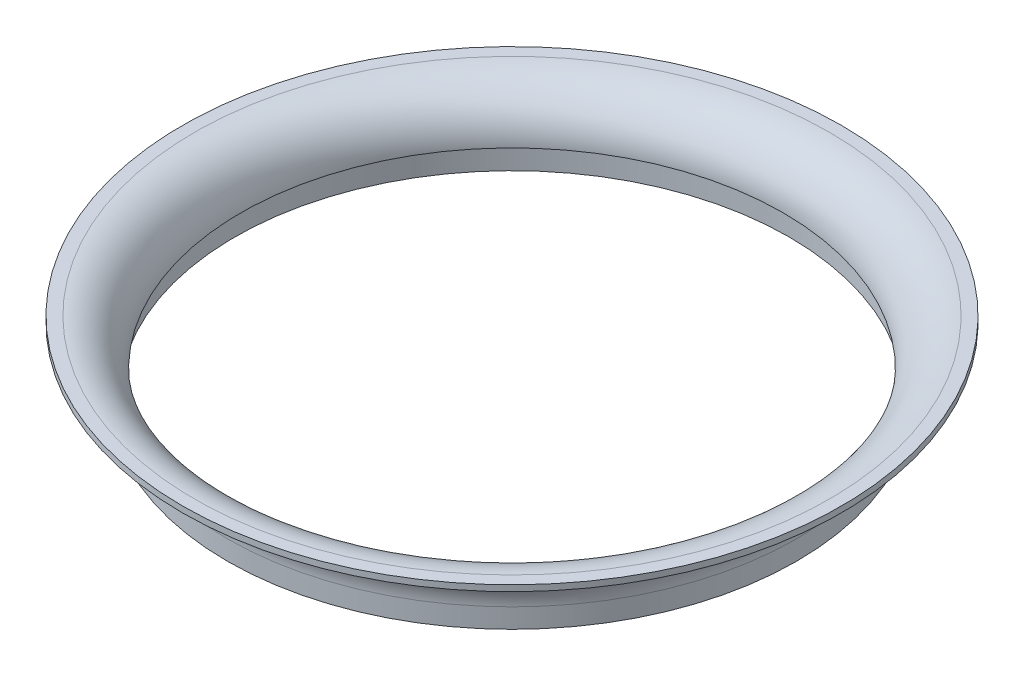
ISO-10303-21;
HEADER;
FILE_DESCRIPTION(('STEP AP214'),'2;1');
FILE_NAME('part.step','',(''),(''),'','','');
FILE_SCHEMA(('AUTOMOTIVE_DESIGN { 1 0 10303 214 1 1 1 1 }'));
ENDSEC;
DATA;
#1=APPLICATION_CONTEXT('core data for automotive mechanical design processes');
#2=APPLICATION_PROTOCOL_DEFINITION('international standard','automotive_design',2000,#1);
#3=PRODUCT_CONTEXT('',#1,'mechanical');
#4=PRODUCT('Part','Part','',(#3));
#5=PRODUCT_RELATED_PRODUCT_CATEGORY('part','',(#4));
#6=PRODUCT_DEFINITION_FORMATION('','',#4);
#7=PRODUCT_DEFINITION_CONTEXT('part definition',#1,'design');
#8=PRODUCT_DEFINITION('design','',#6,#7);
#9=PRODUCT_DEFINITION_SHAPE('','',#8);
#10=(LENGTH_UNIT() NAMED_UNIT(*) SI_UNIT(.MILLI.,.METRE.));
#11=(NAMED_UNIT(*) PLANE_ANGLE_UNIT() SI_UNIT($,.RADIAN.));
#12=(NAMED_UNIT(*) SI_UNIT($,.STERADIAN.) SOLID_ANGLE_UNIT());
#13=UNCERTAINTY_MEASURE_WITH_UNIT(LENGTH_MEASURE(1.E-05),#10,'distance_accuracy_value','');
#14=(GEOMETRIC_REPRESENTATION_CONTEXT(3) GLOBAL_UNCERTAINTY_ASSIGNED_CONTEXT((#13)) GLOBAL_UNIT_ASSIGNED_CONTEXT((#10,
#11,#12)) REPRESENTATION_CONTEXT('',''));
#15=CARTESIAN_POINT('',(0.,0.,0.));
#16=DIRECTION('',(0.,0.,1.));
#17=DIRECTION('',(1.,0.,0.));
#18=AXIS2_PLACEMENT_3D('',#15,#16,#17);
#19=CARTESIAN_POINT('',(46.25,0.,0.));
#20=DIRECTION('',(0.,-1.,0.));
#21=DIRECTION('',(0.,0.,-1.));
#22=AXIS2_PLACEMENT_3D('',#19,#20,#21);
#23=PLANE('',#22);
#24=CARTESIAN_POINT('',(0.,0.,0.));
#25=DIRECTION('',(0.,-1.,0.));
#26=DIRECTION('',(0.,0.,-1.));
#27=AXIS2_PLACEMENT_3D('',#24,#25,#26);
#28=CIRCLE('',#27,47.5);
#29=CARTESIAN_POINT('',(0.,0.,-47.5));
#30=VERTEX_POINT('',#29);
#31=EDGE_CURVE('E58',#30,#30,#28,.T.);
#32=ORIENTED_EDGE('',*,*,#31,.T.);
#33=EDGE_LOOP('',(#32));
#34=FACE_BOUND('',#33,.T.);
#35=CARTESIAN_POINT('',(0.,0.,0.));
#36=DIRECTION('',(0.,-1.,0.));
#37=DIRECTION('',(0.,0.,-1.));
#38=AXIS2_PLACEMENT_3D('',#35,#36,#37);
#39=CIRCLE('',#38,46.25);
#40=CARTESIAN_POINT('',(0.,0.,-46.25));
#41=VERTEX_POINT('',#40);
#42=EDGE_CURVE('E10',#41,#41,#39,.T.);
#43=ORIENTED_EDGE('',*,*,#42,.F.);
#44=EDGE_LOOP('',(#43));
#45=FACE_BOUND('',#44,.T.);
#46=ADVANCED_FACE('F30',(#34,#45),#23,.T.);
#47=CARTESIAN_POINT('',(0.,0.,0.));
#48=DIRECTION('',(0.,-1.,0.));
#49=DIRECTION('',(0.,0.,-1.));
#50=AXIS2_PLACEMENT_3D('',#47,#48,#49);
#51=CYLINDRICAL_SURFACE('',#50,46.25);
#52=ORIENTED_EDGE('',*,*,#42,.T.);
#53=EDGE_LOOP('',(#52));
#54=FACE_BOUND('',#53,.T.);
#55=CARTESIAN_POINT('',(0.,4.,0.));
#56=DIRECTION('',(0.,-1.,0.));
#57=DIRECTION('',(0.,0.,-1.));
#58=AXIS2_PLACEMENT_3D('',#55,#56,#57);
#59=CIRCLE('',#58,46.25);
#60=CARTESIAN_POINT('',(0.,4.,-46.25));
#61=VERTEX_POINT('',#60);
#62=EDGE_CURVE('E36',#61,#61,#59,.T.);
#63=ORIENTED_EDGE('',*,*,#62,.F.);
#64=EDGE_LOOP('',(#63));
#65=FACE_BOUND('',#64,.T.);
#66=ADVANCED_FACE('F76',(#54,#65),#51,.F.);
#67=CARTESIAN_POINT('',(45.25,4.,0.));
#68=DIRECTION('',(0.,-1.,0.));
#69=DIRECTION('',(0.,0.,-1.));
#70=AXIS2_PLACEMENT_3D('',#67,#68,#69);
#71=PLANE('',#70);
#72=ORIENTED_EDGE('',*,*,#62,.T.);
#73=EDGE_LOOP('',(#72));
#74=FACE_BOUND('',#73,.T.);
#75=CARTESIAN_POINT('',(0.,4.,0.));
#76=DIRECTION('',(0.,-1.,0.));
#77=DIRECTION('',(0.,0.,-1.));
#78=AXIS2_PLACEMENT_3D('',#75,#76,#77);
#79=CIRCLE('',#78,45.25);
#80=CARTESIAN_POINT('',(0.,4.,-45.25));
#81=VERTEX_POINT('',#80);
#82=EDGE_CURVE('E40',#81,#81,#79,.T.);
#83=ORIENTED_EDGE('',*,*,#82,.F.);
#84=EDGE_LOOP('',(#83));
#85=FACE_BOUND('',#84,.T.);
#86=ADVANCED_FACE('F80',(#74,#85),#71,.T.);
#87=CARTESIAN_POINT('',(0.,4.,0.));
#88=DIRECTION('',(0.,-1.,0.));
#89=DIRECTION('',(0.,0.,-1.));
#90=AXIS2_PLACEMENT_3D('',#87,#88,#89);
#91=TOROIDAL_SURFACE('',#90,53.,7.75);
#92=ORIENTED_EDGE('',*,*,#82,.T.);
#93=EDGE_LOOP('',(#92));
#94=FACE_BOUND('',#93,.T.);
#95=CARTESIAN_POINT('',(0.,11.75,0.));
#96=DIRECTION('',(0.,-1.,0.));
#97=DIRECTION('',(0.,0.,-1.));
#98=AXIS2_PLACEMENT_3D('',#95,#96,#97);
#99=CIRCLE('',#98,53.);
#100=CARTESIAN_POINT('',(0.,11.75,-53.));
#101=VERTEX_POINT('',#100);
#102=EDGE_CURVE('E44',#101,#101,#99,.T.);
#103=ORIENTED_EDGE('',*,*,#102,.F.);
#104=EDGE_LOOP('',(#103));
#105=FACE_BOUND('',#104,.T.);
#106=ADVANCED_FACE('F84',(#94,#105),#91,.T.);
#107=CARTESIAN_POINT('',(55.,11.75,0.));
#108=DIRECTION('',(0.,1.,0.));
#109=DIRECTION('',(0.,0.,1.));
#110=AXIS2_PLACEMENT_3D('',#107,#108,#109);
#111=PLANE('',#110);
#112=ORIENTED_EDGE('',*,*,#102,.T.);
#113=EDGE_LOOP('',(#112));
#114=FACE_BOUND('',#113,.T.);
#115=CARTESIAN_POINT('',(0.,11.75,0.));
#116=DIRECTION('',(0.,-1.,0.));
#117=DIRECTION('',(0.,0.,-1.));
#118=AXIS2_PLACEMENT_3D('',#115,#116,#117);
#119=CIRCLE('',#118,55.);
#120=CARTESIAN_POINT('',(0.,11.75,-55.));
#121=VERTEX_POINT('',#120);
#122=EDGE_CURVE('E49',#121,#121,#119,.T.);
#123=ORIENTED_EDGE('',*,*,#122,.F.);
#124=EDGE_LOOP('',(#123));
#125=FACE_BOUND('',#124,.T.);
#126=ADVANCED_FACE('F90',(#114,#125),#111,.T.);
#127=CARTESIAN_POINT('',(0.,0.,0.));
#128=DIRECTION('',(0.,-1.,0.));
#129=DIRECTION('',(0.,0.,-1.));
#130=AXIS2_PLACEMENT_3D('',#127,#128,#129);
#131=CYLINDRICAL_SURFACE('',#130,55.);
#132=ORIENTED_EDGE('',*,*,#122,.T.);
#133=EDGE_LOOP('',(#132));
#134=FACE_BOUND('',#133,.T.);
#135=CARTESIAN_POINT('',(0.,10.75,0.));
#136=DIRECTION('',(0.,-1.,0.));
#137=DIRECTION('',(0.,0.,-1.));
#138=AXIS2_PLACEMENT_3D('',#135,#136,#137);
#139=CIRCLE('',#138,55.);
#140=CARTESIAN_POINT('',(0.,10.75,-55.));
#141=VERTEX_POINT('',#140);
#142=EDGE_CURVE('E52',#141,#141,#139,.T.);
#143=ORIENTED_EDGE('',*,*,#142,.F.);
#144=EDGE_LOOP('',(#143));
#145=FACE_BOUND('',#144,.T.);
#146=ADVANCED_FACE('F72',(#134,#145),#131,.T.);
#147=CARTESIAN_POINT('',(0.,3.25,0.));
#148=DIRECTION('',(0.,-1.,0.));
#149=DIRECTION('',(0.,0.,-1.));
#150=AXIS2_PLACEMENT_3D('',#147,#148,#149);
#151=TOROIDAL_SURFACE('',#150,55.,7.5);
#152=ORIENTED_EDGE('',*,*,#142,.T.);
#153=EDGE_LOOP('',(#152));
#154=FACE_BOUND('',#153,.T.);
#155=CARTESIAN_POINT('',(0.,3.25,0.));
#156=DIRECTION('',(0.,-1.,0.));
#157=DIRECTION('',(0.,0.,-1.));
#158=AXIS2_PLACEMENT_3D('',#155,#156,#157);
#159=CIRCLE('',#158,47.5);
#160=CARTESIAN_POINT('',(0.,3.25,-47.5));
#161=VERTEX_POINT('',#160);
#162=EDGE_CURVE('E55',#161,#161,#159,.T.);
#163=ORIENTED_EDGE('',*,*,#162,.F.);
#164=EDGE_LOOP('',(#163));
#165=FACE_BOUND('',#164,.T.);
#166=ADVANCED_FACE('F66',(#154,#165),#151,.F.);
#167=CARTESIAN_POINT('',(0.,0.,0.));
#168=DIRECTION('',(0.,-1.,0.));
#169=DIRECTION('',(0.,0.,-1.));
#170=AXIS2_PLACEMENT_3D('',#167,#168,#169);
#171=CYLINDRICAL_SURFACE('',#170,47.5);
#172=ORIENTED_EDGE('',*,*,#162,.T.);
#173=EDGE_LOOP('',(#172));
#174=FACE_BOUND('',#173,.T.);
#175=ORIENTED_EDGE('',*,*,#31,.F.);
#176=EDGE_LOOP('',(#175));
#177=FACE_BOUND('',#176,.T.);
#178=ADVANCED_FACE('F64',(#174,#177),#171,.T.);
#179=CLOSED_SHELL('',(#46,#66,#86,#106,#126,#146,#166,#178));
#180=MANIFOLD_SOLID_BREP('B2',#179);
#181=ADVANCED_BREP_SHAPE_REPRESENTATION('',(#18,#180),#14);
#182=SHAPE_DEFINITION_REPRESENTATION(#9,#181);
ENDSEC;
END-ISO-10303-21;
